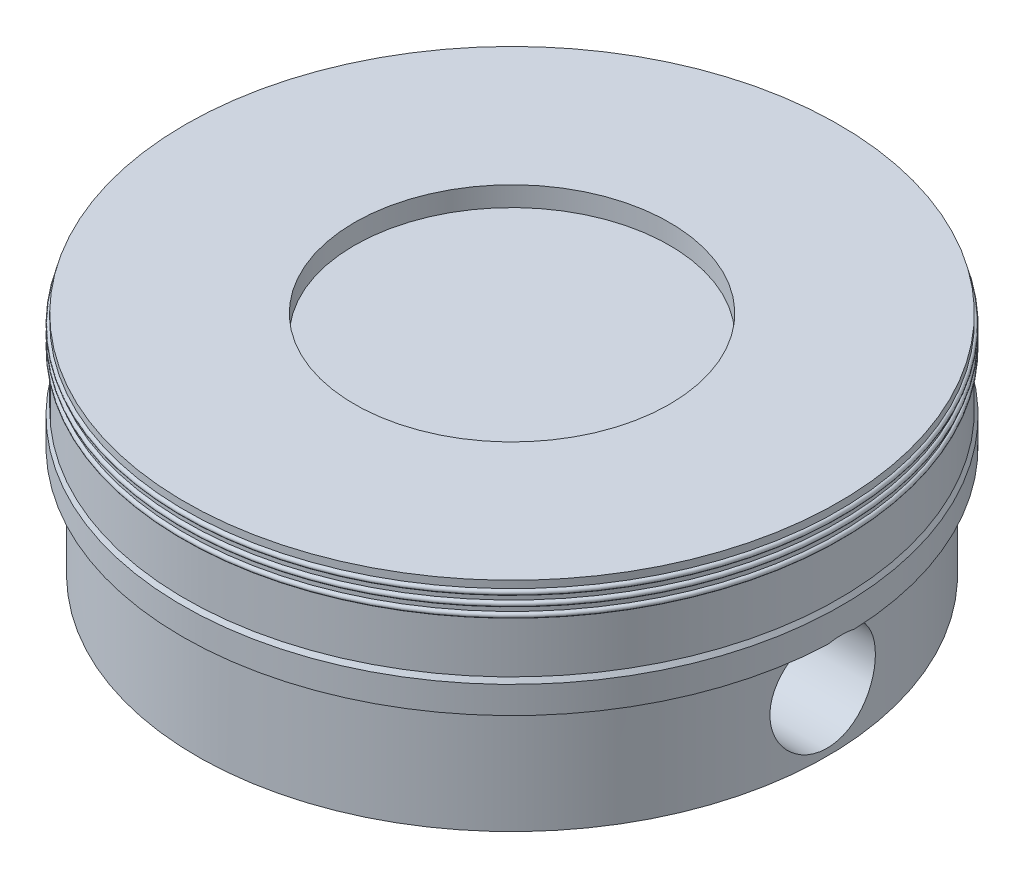
ISO-10303-21;
HEADER;
FILE_DESCRIPTION(('STEP AP214'),'2;1');
FILE_NAME('part.step','',(''),(''),'','','');
FILE_SCHEMA(('AUTOMOTIVE_DESIGN { 1 0 10303 214 1 1 1 1 }'));
ENDSEC;
DATA;
#1=APPLICATION_CONTEXT('core data for automotive mechanical design processes');
#2=APPLICATION_PROTOCOL_DEFINITION('international standard','automotive_design',2000,#1);
#3=PRODUCT_CONTEXT('',#1,'mechanical');
#4=PRODUCT('Part','Part','',(#3));
#5=PRODUCT_RELATED_PRODUCT_CATEGORY('part','',(#4));
#6=PRODUCT_DEFINITION_FORMATION('','',#4);
#7=PRODUCT_DEFINITION_CONTEXT('part definition',#1,'design');
#8=PRODUCT_DEFINITION('design','',#6,#7);
#9=PRODUCT_DEFINITION_SHAPE('','',#8);
#10=(LENGTH_UNIT() NAMED_UNIT(*) SI_UNIT(.MILLI.,.METRE.));
#11=(NAMED_UNIT(*) PLANE_ANGLE_UNIT() SI_UNIT($,.RADIAN.));
#12=(NAMED_UNIT(*) SI_UNIT($,.STERADIAN.) SOLID_ANGLE_UNIT());
#13=UNCERTAINTY_MEASURE_WITH_UNIT(LENGTH_MEASURE(1.E-05),#10,'distance_accuracy_value','');
#14=(GEOMETRIC_REPRESENTATION_CONTEXT(3) GLOBAL_UNCERTAINTY_ASSIGNED_CONTEXT((#13)) GLOBAL_UNIT_ASSIGNED_CONTEXT((#10,
#11,#12)) REPRESENTATION_CONTEXT('',''));
#15=CARTESIAN_POINT('',(0.,0.,0.));
#16=DIRECTION('',(0.,0.,1.));
#17=DIRECTION('',(1.,0.,0.));
#18=AXIS2_PLACEMENT_3D('',#15,#16,#17);
#19=CARTESIAN_POINT('',(0.,1.68000000000001,0.));
#20=DIRECTION('',(0.,-1.,0.));
#21=DIRECTION('',(1.,0.,0.));
#22=AXIS2_PLACEMENT_3D('',#19,#20,#21);
#23=PLANE('',#22);
#24=DIRECTION('',(1.,0.,0.));
#25=VECTOR('',#24,1.);
#26=CARTESIAN_POINT('',(-4.99999999999999,1.68000000000001,-0.204200269343562));
#27=LINE('',#26,#25);
#28=CARTESIAN_POINT('',(-4.99582848484613,1.68000000000001,-0.204200269343562));
#29=VERTEX_POINT('',#28);
#30=CARTESIAN_POINT('',(-4.77563631885846,1.68000000000001,-0.204200269343562));
#31=VERTEX_POINT('',#30);
#32=EDGE_CURVE('E233',#29,#31,#27,.T.);
#33=ORIENTED_EDGE('',*,*,#32,.F.);
#34=CARTESIAN_POINT('',(0.,1.68000000000001,0.));
#35=DIRECTION('',(0.,1.,0.));
#36=DIRECTION('',(-1.,0.,0.));
#37=AXIS2_PLACEMENT_3D('',#34,#35,#36);
#38=CIRCLE('',#37,5.);
#39=CARTESIAN_POINT('',(4.99582848484613,1.68000000000001,-0.204200269343562));
#40=VERTEX_POINT('',#39);
#41=EDGE_CURVE('E141',#40,#29,#38,.T.);
#42=ORIENTED_EDGE('',*,*,#41,.F.);
#43=CARTESIAN_POINT('',(4.77563631885846,1.68000000000001,-0.204200269343562));
#44=VERTEX_POINT('',#43);
#45=EDGE_CURVE('E122',#44,#40,#27,.T.);
#46=ORIENTED_EDGE('',*,*,#45,.F.);
#47=CARTESIAN_POINT('',(0.,1.68000000000001,0.));
#48=DIRECTION('',(0.,1.,0.));
#49=DIRECTION('',(-1.,0.,0.));
#50=AXIS2_PLACEMENT_3D('',#47,#48,#49);
#51=CIRCLE('',#50,4.78);
#52=EDGE_CURVE('E47',#44,#31,#51,.T.);
#53=ORIENTED_EDGE('',*,*,#52,.T.);
#54=EDGE_LOOP('',(#33,#42,#46,#53));
#55=FACE_BOUND('',#54,.T.);
#56=ADVANCED_FACE('F37',(#55),#23,.T.);
#57=CARTESIAN_POINT('',(0.,3.,0.));
#58=DIRECTION('',(0.,1.,0.));
#59=DIRECTION('',(-1.,0.,0.));
#60=AXIS2_PLACEMENT_3D('',#57,#58,#59);
#61=CYLINDRICAL_SURFACE('',#60,3.43);
#62=DIRECTION('',(0.,-1.,0.));
#63=VECTOR('',#62,1.);
#64=CARTESIAN_POINT('',(1.75,3.432,2.94998305079877));
#65=LINE('',#64,#63);
#66=CARTESIAN_POINT('',(1.75,1.93000000000001,2.94998305079877));
#67=VERTEX_POINT('',#66);
#68=CARTESIAN_POINT('',(1.75,0.,2.94998305079877));
#69=VERTEX_POINT('',#68);
#70=EDGE_CURVE('E215',#67,#69,#65,.T.);
#71=ORIENTED_EDGE('',*,*,#70,.T.);
#72=CARTESIAN_POINT('',(0.,0.,0.));
#73=DIRECTION('',(0.,1.,0.));
#74=DIRECTION('',(-1.,0.,0.));
#75=AXIS2_PLACEMENT_3D('',#72,#73,#74);
#76=CIRCLE('',#75,3.43);
#77=CARTESIAN_POINT('',(-1.75,0.,2.94998305079877));
#78=VERTEX_POINT('',#77);
#79=EDGE_CURVE('E188',#78,#69,#76,.T.);
#80=ORIENTED_EDGE('',*,*,#79,.F.);
#81=DIRECTION('',(0.,-1.,0.));
#82=VECTOR('',#81,1.);
#83=CARTESIAN_POINT('',(-1.75,3.43200000000001,2.94998305079877));
#84=LINE('',#83,#82);
#85=CARTESIAN_POINT('',(-1.75,1.93000000000001,2.94998305079877));
#86=VERTEX_POINT('',#85);
#87=EDGE_CURVE('E204',#86,#78,#84,.T.);
#88=ORIENTED_EDGE('',*,*,#87,.F.);
#89=CARTESIAN_POINT('',(0.,1.93,0.));
#90=DIRECTION('',(0.,1.,0.));
#91=DIRECTION('',(-1.,0.,0.));
#92=AXIS2_PLACEMENT_3D('',#89,#90,#91);
#93=CIRCLE('',#92,3.43);
#94=EDGE_CURVE('E184',#86,#67,#93,.T.);
#95=ORIENTED_EDGE('',*,*,#94,.T.);
#96=EDGE_LOOP('',(#71,#80,#88,#95));
#97=FACE_BOUND('',#96,.T.);
#98=ADVANCED_FACE('F293',(#97),#61,.F.);
#99=CARTESIAN_POINT('',(0.,2.33,0.));
#100=DIRECTION('',(0.,-1.,0.));
#101=DIRECTION('',(1.,0.,0.));
#102=AXIS2_PLACEMENT_3D('',#99,#100,#101);
#103=PLANE('',#102);
#104=DIRECTION('',(0.,0.,1.));
#105=VECTOR('',#104,1.);
#106=CARTESIAN_POINT('',(1.75,2.33,2.94998305079877));
#107=LINE('',#106,#105);
#108=CARTESIAN_POINT('',(1.75,2.33,-2.94998305079877));
#109=VERTEX_POINT('',#108);
#110=CARTESIAN_POINT('',(1.75,2.33,2.94998305079877));
#111=VERTEX_POINT('',#110);
#112=EDGE_CURVE('E220',#109,#111,#107,.T.);
#113=ORIENTED_EDGE('',*,*,#112,.T.);
#114=CARTESIAN_POINT('',(0.,2.33,0.));
#115=DIRECTION('',(0.,-1.,0.));
#116=DIRECTION('',(1.,0.,0.));
#117=AXIS2_PLACEMENT_3D('',#114,#115,#116);
#118=CIRCLE('',#117,3.43);
#119=EDGE_CURVE('E53',#111,#109,#118,.F.);
#120=ORIENTED_EDGE('',*,*,#119,.T.);
#121=EDGE_LOOP('',(#113,#120));
#122=FACE_BOUND('',#121,.T.);
#123=CARTESIAN_POINT('',(0.,2.33,0.));
#124=DIRECTION('',(0.,1.,0.));
#125=DIRECTION('',(-1.,0.,0.));
#126=AXIS2_PLACEMENT_3D('',#123,#124,#125);
#127=CIRCLE('',#126,4.2);
#128=CARTESIAN_POINT('',(-4.2,2.33000000000001,0.));
#129=VERTEX_POINT('',#128);
#130=EDGE_CURVE('E178',#129,#129,#127,.T.);
#131=ORIENTED_EDGE('',*,*,#130,.F.);
#132=EDGE_LOOP('',(#131));
#133=FACE_BOUND('',#132,.T.);
#134=CARTESIAN_POINT('',(0.,2.33,0.));
#135=DIRECTION('',(0.,-1.,0.));
#136=DIRECTION('',(1.,0.,0.));
#137=AXIS2_PLACEMENT_3D('',#134,#135,#136);
#138=CIRCLE('',#137,3.43);
#139=CARTESIAN_POINT('',(-1.75,2.33,-2.94998305079877));
#140=VERTEX_POINT('',#139);
#141=CARTESIAN_POINT('',(-1.75,2.33,2.94998305079877));
#142=VERTEX_POINT('',#141);
#143=EDGE_CURVE('E197',#140,#142,#138,.F.);
#144=ORIENTED_EDGE('',*,*,#143,.T.);
#145=DIRECTION('',(0.,0.,1.));
#146=VECTOR('',#145,1.);
#147=CARTESIAN_POINT('',(-1.75,2.33,2.94998305079877));
#148=LINE('',#147,#146);
#149=EDGE_CURVE('E199',#140,#142,#148,.T.);
#150=ORIENTED_EDGE('',*,*,#149,.F.);
#151=EDGE_LOOP('',(#144,#150));
#152=FACE_BOUND('',#151,.T.);
#153=ADVANCED_FACE('F297',(#122,#133,#152),#103,.T.);
#154=DIRECTION('',(0.,-1.,0.));
#155=VECTOR('',#154,1.);
#156=CARTESIAN_POINT('',(1.75,3.432,-2.94998305079877));
#157=LINE('',#156,#155);
#158=CARTESIAN_POINT('',(1.75,1.93000000000001,-2.94998305079877));
#159=VERTEX_POINT('',#158);
#160=CARTESIAN_POINT('',(1.75,0.,-2.94998305079877));
#161=VERTEX_POINT('',#160);
#162=EDGE_CURVE('E221',#159,#161,#157,.T.);
#163=ORIENTED_EDGE('',*,*,#162,.F.);
#164=CARTESIAN_POINT('',(-1.75,1.93000000000001,-2.94998305079877));
#165=VERTEX_POINT('',#164);
#166=EDGE_CURVE('E187',#159,#165,#93,.T.);
#167=ORIENTED_EDGE('',*,*,#166,.T.);
#168=DIRECTION('',(0.,-1.,0.));
#169=VECTOR('',#168,1.);
#170=CARTESIAN_POINT('',(-1.75,3.43200000000001,-2.94998305079877));
#171=LINE('',#170,#169);
#172=CARTESIAN_POINT('',(-1.75,0.,-2.94998305079877));
#173=VERTEX_POINT('',#172);
#174=EDGE_CURVE('E208',#165,#173,#171,.T.);
#175=ORIENTED_EDGE('',*,*,#174,.T.);
#176=EDGE_CURVE('E190',#161,#173,#76,.T.);
#177=ORIENTED_EDGE('',*,*,#176,.F.);
#178=EDGE_LOOP('',(#163,#167,#175,#177));
#179=FACE_BOUND('',#178,.T.);
#180=ADVANCED_FACE('F270',(#179),#61,.F.);
#181=CARTESIAN_POINT('',(0.,3.,0.));
#182=DIRECTION('',(0.,1.,0.));
#183=DIRECTION('',(-1.,0.,0.));
#184=AXIS2_PLACEMENT_3D('',#181,#182,#183);
#185=CYLINDRICAL_SURFACE('',#184,4.78);
#186=CARTESIAN_POINT('',(4.77563631885846,1.68000000000001,0.204200269343563));
#187=CARTESIAN_POINT('',(4.77379194888552,1.66854243257559,0.247744412269015));
#188=CARTESIAN_POINT('',(4.77136020460173,1.65335275457684,0.290255843607151));
#189=CARTESIAN_POINT('',(4.76566971325088,1.61612915775611,0.372058639634219));
#190=CARTESIAN_POINT('',(4.76241182877571,1.59410237237228,0.411353306755982));
#191=CARTESIAN_POINT('',(4.75541096790897,1.54379414653232,0.485669109751144));
#192=CARTESIAN_POINT('',(4.75166791325191,1.51551169641929,0.520689554352583));
#193=CARTESIAN_POINT('',(4.74411777301411,1.45349253539825,0.585499496455732));
#194=CARTESIAN_POINT('',(4.74031069015471,1.41975605577735,0.615289215663266));
#195=CARTESIAN_POINT('',(4.73303397938829,1.34752861720674,0.668977437623667));
#196=CARTESIAN_POINT('',(4.7295665140548,1.30901033693919,0.692839507782637));
#197=CARTESIAN_POINT('',(4.72339287495312,1.22844891630061,0.733750408895781));
#198=CARTESIAN_POINT('',(4.72068674764335,1.18640556102538,0.750798824093428));
#199=CARTESIAN_POINT('',(4.71636619316509,1.1002697554691,0.777478565646616));
#200=CARTESIAN_POINT('',(4.71474486267495,1.05619220830362,0.787156848877914));
#201=CARTESIAN_POINT('',(4.71275674229363,0.967013656316141,0.798974764384111));
#202=CARTESIAN_POINT('',(4.71238978474061,0.921912789084297,0.801115404155711));
#203=CARTESIAN_POINT('',(4.71294983990002,0.832543950301121,0.797813291403519));
#204=CARTESIAN_POINT('',(4.71386133355064,0.788272487173632,0.792461490734872));
#205=CARTESIAN_POINT('',(4.71684522740921,0.701267723805134,0.774501739495555));
#206=CARTESIAN_POINT('',(4.71891766125525,0.658534468171649,0.761893578672604));
#207=CARTESIAN_POINT('',(4.723990672899,0.575744688228214,0.729777359832191));
#208=CARTESIAN_POINT('',(4.72699241086157,0.535691586324209,0.710260672658403));
#209=CARTESIAN_POINT('',(4.7335870697406,0.45940615327789,0.664888734674967));
#210=CARTESIAN_POINT('',(4.73718003553206,0.423174112502092,0.63903300265019));
#211=CARTESIAN_POINT('',(4.74460835399527,0.355074083527181,0.581331292128938));
#212=CARTESIAN_POINT('',(4.74844618692049,0.323266716440073,0.549414060942297));
#213=CARTESIAN_POINT('',(4.75589481733856,0.265438415229639,0.480684029234261));
#214=CARTESIAN_POINT('',(4.7595056074008,0.23941767041891,0.44387106860927));
#215=CARTESIAN_POINT('',(4.7661128241381,0.193797371595719,0.366186649534644));
#216=CARTESIAN_POINT('',(4.76910646912815,0.174226662901805,0.325297996806077));
#217=CARTESIAN_POINT('',(4.77412075413143,0.142248751906531,0.240753384230177));
#218=CARTESIAN_POINT('',(4.7761414668929,0.129841014000476,0.197097631561227));
#219=CARTESIAN_POINT('',(4.77896522061505,0.112661038381097,0.108739604313532));
#220=CARTESIAN_POINT('',(4.77978064110033,0.107811145780094,0.0640528262830952));
#221=CARTESIAN_POINT('',(4.78014164687173,0.105653249103118,-0.0255061274608446));
#222=CARTESIAN_POINT('',(4.7796873062372,0.10834480505024,-0.0703782922061621));
#223=CARTESIAN_POINT('',(4.77756972345959,0.1211268716496,-0.158615600759223));
#224=CARTESIAN_POINT('',(4.77591727299164,0.131151340047628,-0.201990600670429));
#225=CARTESIAN_POINT('',(4.77159751597352,0.158221853564904,-0.286436829840919));
#226=CARTESIAN_POINT('',(4.76893016987214,0.175268172332863,-0.327507969245515));
#227=CARTESIAN_POINT('',(4.7628526422157,0.216013300231182,-0.406465125420017));
#228=CARTESIAN_POINT('',(4.75943800733318,0.239752248368456,-0.444330074182973));
#229=CARTESIAN_POINT('',(4.75224918030118,0.293172302894461,-0.515569319292148));
#230=CARTESIAN_POINT('',(4.74847495896289,0.322853891882563,-0.548943250556414));
#231=CARTESIAN_POINT('',(4.74093522146089,0.387737081541062,-0.610666430914049));
#232=CARTESIAN_POINT('',(4.73717034238094,0.42300011947298,-0.638951217824194));
#233=CARTESIAN_POINT('',(4.73012045867175,0.49781429996308,-0.689207240280667));
#234=CARTESIAN_POINT('',(4.72683545162856,0.537365420948878,-0.711178507586868));
#235=CARTESIAN_POINT('',(4.72112414577725,0.619631105385101,-0.748156766963213));
#236=CARTESIAN_POINT('',(4.71869732861466,0.662343740331963,-0.763167964689311));
#237=CARTESIAN_POINT('',(4.7149837872348,0.749733086105556,-0.785786717984045));
#238=CARTESIAN_POINT('',(4.71369696033767,0.794409619661763,-0.79339494035089));
#239=CARTESIAN_POINT('',(4.71242375066639,0.883861115660366,-0.800922574806883));
#240=CARTESIAN_POINT('',(4.71242133866149,0.928627891215224,-0.8009367589262));
#241=CARTESIAN_POINT('',(4.71367692374763,1.01752032814329,-0.793513476008901));
#242=CARTESIAN_POINT('',(4.71493489933994,1.06164600043891,-0.786076136074619));
#243=CARTESIAN_POINT('',(4.71855673227796,1.14779364109366,-0.764032135205504));
#244=CARTESIAN_POINT('',(4.72091530598264,1.18982460995633,-0.749459711374084));
#245=CARTESIAN_POINT('',(4.72646953445655,1.27084839334425,-0.713591784913751));
#246=CARTESIAN_POINT('',(4.72966517057882,1.30984127552285,-0.692296432047134));
#247=CARTESIAN_POINT('',(4.73657457074216,1.3841212791375,-0.643332702364344));
#248=CARTESIAN_POINT('',(4.7402932895619,1.41936652165984,-0.615601505488156));
#249=CARTESIAN_POINT('',(4.74781191338595,1.48475232853069,-0.554637638840525));
#250=CARTESIAN_POINT('',(4.7516118616088,1.5148900952521,-0.521401973568539));
#251=CARTESIAN_POINT('',(4.75890914569777,1.56949101750667,-0.449983791452613));
#252=CARTESIAN_POINT('',(4.76240297685973,1.59389278081819,-0.411754019783373));
#253=CARTESIAN_POINT('',(4.76864221547192,1.63587199615418,-0.331736125546197));
#254=CARTESIAN_POINT('',(4.7713892580788,1.65346439427324,-0.289956044521578));
#255=CARTESIAN_POINT('',(4.77434621611889,1.67200558892752,-0.232863171892931));
#256=CARTESIAN_POINT('',(4.77502245159576,1.67620590067566,-0.218582892491788));
#257=CARTESIAN_POINT('',(4.77563631885846,1.68000000000001,-0.204200269343565));
#258=B_SPLINE_CURVE_WITH_KNOTS('',3,(#186,#187,#188,#189,#190,#191,#192,#193,#194,#195,#196,
#197,#198,#199,#200,#201,#202,#203,#204,#205,#206,#207,#208,#209,#210,#211,#212,#213,#214,#215,
#216,#217,#218,#219,#220,#221,#222,#223,#224,#225,#226,#227,#228,#229,#230,#231,#232,#233,#234,
#235,#236,#237,#238,#239,#240,#241,#242,#243,#244,#245,#246,#247,#248,#249,#250,#251,#252,#253,
#254,#255,#256,#257),.UNSPECIFIED.,.F.,.F.,(4,2,2,2,2,2,2,2,2,2,2,2,2,2,2,2,2,2,2,2,2,2,2,2,2,2,
2,2,2,2,2,2,2,2,2,4),(0.,0.134994326225649,0.269848278013811,0.404724010973234,
0.539594025804637,0.675273538402804,0.810961328648469,0.945777214580323,1.08057508006346,
1.21375072872941,1.3469302363402,1.48027668341513,1.61363325633846,1.74866713589456,
1.88370543251019,2.01933969090956,2.15496380606526,2.28918500918092,2.42339838183809,
2.5564176455071,2.68944209356374,2.82328197712698,2.95713273418294,3.09257498984084,
3.22801656415072,3.36337619022746,3.49872362311039,3.63238190809012,3.76603791326899,
3.89905877507421,4.0320766738697,4.16645204477797,4.30090078374122,4.43672892789274,
4.57225722456913,4.61693329590095),.UNSPECIFIED.);
#259=CARTESIAN_POINT('',(4.77563631885846,1.68000000000001,0.204200269343562));
#260=VERTEX_POINT('',#259);
#261=EDGE_CURVE('E255',#260,#44,#258,.T.);
#262=ORIENTED_EDGE('',*,*,#261,.F.);
#263=CARTESIAN_POINT('',(-4.77563631885846,1.68000000000001,0.204200269343562));
#264=VERTEX_POINT('',#263);
#265=EDGE_CURVE('E11',#264,#260,#51,.T.);
#266=ORIENTED_EDGE('',*,*,#265,.F.);
#267=CARTESIAN_POINT('',(-4.77563631885846,1.68000000000001,-0.204200269343563));
#268=CARTESIAN_POINT('',(-4.77379194888552,1.66854243257559,-0.247744412269015));
#269=CARTESIAN_POINT('',(-4.77136020460172,1.65335275457684,-0.290255843607151));
#270=CARTESIAN_POINT('',(-4.76566971325088,1.61612915775611,-0.372058639634219));
#271=CARTESIAN_POINT('',(-4.76241182877571,1.59410237237228,-0.411353306755982));
#272=CARTESIAN_POINT('',(-4.75541096790896,1.54379414653232,-0.485669109751144));
#273=CARTESIAN_POINT('',(-4.75166791325191,1.51551169641929,-0.520689554352583));
#274=CARTESIAN_POINT('',(-4.7441177730141,1.45349253539825,-0.585499496455732));
#275=CARTESIAN_POINT('',(-4.74031069015471,1.41975605577735,-0.615289215663266));
#276=CARTESIAN_POINT('',(-4.73303397938829,1.34752861720674,-0.668977437623667));
#277=CARTESIAN_POINT('',(-4.7295665140548,1.30901033693919,-0.692839507782637));
#278=CARTESIAN_POINT('',(-4.72339287495312,1.22844891630061,-0.733750408895781));
#279=CARTESIAN_POINT('',(-4.72068674764335,1.18640556102538,-0.750798824093428));
#280=CARTESIAN_POINT('',(-4.71636619316509,1.1002697554691,-0.777478565646616));
#281=CARTESIAN_POINT('',(-4.71474486267495,1.05619220830362,-0.787156848877914));
#282=CARTESIAN_POINT('',(-4.71275674229363,0.967013656316141,-0.798974764384111));
#283=CARTESIAN_POINT('',(-4.7123897847406,0.921912789084297,-0.801115404155711));
#284=CARTESIAN_POINT('',(-4.71294983990002,0.832543950301121,-0.797813291403519));
#285=CARTESIAN_POINT('',(-4.71386133355064,0.788272487173632,-0.792461490734872));
#286=CARTESIAN_POINT('',(-4.71684522740921,0.701267723805134,-0.774501739495555));
#287=CARTESIAN_POINT('',(-4.71891766125524,0.65853446817165,-0.761893578672604));
#288=CARTESIAN_POINT('',(-4.723990672899,0.575744688228215,-0.729777359832191));
#289=CARTESIAN_POINT('',(-4.72699241086157,0.535691586324209,-0.710260672658404));
#290=CARTESIAN_POINT('',(-4.7335870697406,0.459406153277891,-0.664888734674968));
#291=CARTESIAN_POINT('',(-4.73718003553206,0.423174112502093,-0.639033002650191));
#292=CARTESIAN_POINT('',(-4.74460835399527,0.355074083527182,-0.581331292128938));
#293=CARTESIAN_POINT('',(-4.74844618692049,0.323266716440074,-0.549414060942297));
#294=CARTESIAN_POINT('',(-4.75589481733856,0.265438415229639,-0.480684029234261));
#295=CARTESIAN_POINT('',(-4.7595056074008,0.23941767041891,-0.443871068609271));
#296=CARTESIAN_POINT('',(-4.7661128241381,0.193797371595719,-0.366186649534645));
#297=CARTESIAN_POINT('',(-4.76910646912815,0.174226662901805,-0.325297996806078));
#298=CARTESIAN_POINT('',(-4.77412075413143,0.142248751906531,-0.240753384230177));
#299=CARTESIAN_POINT('',(-4.7761414668929,0.129841014000476,-0.197097631561228));
#300=CARTESIAN_POINT('',(-4.77896522061505,0.112661038381097,-0.108739604313533));
#301=CARTESIAN_POINT('',(-4.77978064110033,0.107811145780094,-0.0640528262830958));
#302=CARTESIAN_POINT('',(-4.78014164687173,0.105653249103118,0.0255061274608441));
#303=CARTESIAN_POINT('',(-4.7796873062372,0.10834480505024,0.0703782922061616));
#304=CARTESIAN_POINT('',(-4.77756972345959,0.1211268716496,0.158615600759222));
#305=CARTESIAN_POINT('',(-4.77591727299164,0.131151340047627,0.201990600670429));
#306=CARTESIAN_POINT('',(-4.77159751597352,0.158221853564904,0.286436829840918));
#307=CARTESIAN_POINT('',(-4.76893016987214,0.175268172332863,0.327507969245514));
#308=CARTESIAN_POINT('',(-4.7628526422157,0.216013300231181,0.406465125420017));
#309=CARTESIAN_POINT('',(-4.75943800733318,0.239752248368456,0.444330074182973));
#310=CARTESIAN_POINT('',(-4.75224918030118,0.293172302894461,0.515569319292147));
#311=CARTESIAN_POINT('',(-4.74847495896288,0.322853891882563,0.548943250556413));
#312=CARTESIAN_POINT('',(-4.74093522146089,0.387737081541062,0.610666430914048));
#313=CARTESIAN_POINT('',(-4.73717034238094,0.423000119472979,0.638951217824193));
#314=CARTESIAN_POINT('',(-4.73012045867174,0.49781429996308,0.689207240280666));
#315=CARTESIAN_POINT('',(-4.72683545162856,0.537365420948878,0.711178507586868));
#316=CARTESIAN_POINT('',(-4.72112414577725,0.6196311053851,0.748156766963213));
#317=CARTESIAN_POINT('',(-4.71869732861466,0.662343740331962,0.763167964689311));
#318=CARTESIAN_POINT('',(-4.7149837872348,0.749733086105556,0.785786717984045));
#319=CARTESIAN_POINT('',(-4.71369696033767,0.794409619661763,0.79339494035089));
#320=CARTESIAN_POINT('',(-4.71242375066639,0.883861115660365,0.800922574806883));
#321=CARTESIAN_POINT('',(-4.71242133866149,0.928627891215223,0.8009367589262));
#322=CARTESIAN_POINT('',(-4.71367692374763,1.01752032814329,0.793513476008901));
#323=CARTESIAN_POINT('',(-4.71493489933994,1.06164600043891,0.786076136074619));
#324=CARTESIAN_POINT('',(-4.71855673227795,1.14779364109366,0.764032135205505));
#325=CARTESIAN_POINT('',(-4.72091530598264,1.18982460995633,0.749459711374084));
#326=CARTESIAN_POINT('',(-4.72646953445655,1.27084839334425,0.713591784913751));
#327=CARTESIAN_POINT('',(-4.72966517057881,1.30984127552285,0.692296432047134));
#328=CARTESIAN_POINT('',(-4.73657457074216,1.3841212791375,0.643332702364345));
#329=CARTESIAN_POINT('',(-4.74029328956189,1.41936652165984,0.615601505488156));
#330=CARTESIAN_POINT('',(-4.74781191338595,1.48475232853069,0.554637638840526));
#331=CARTESIAN_POINT('',(-4.75161186160879,1.5148900952521,0.52140197356854));
#332=CARTESIAN_POINT('',(-4.75890914569777,1.56949101750667,0.449983791452614));
#333=CARTESIAN_POINT('',(-4.76240297685973,1.59389278081819,0.411754019783374));
#334=CARTESIAN_POINT('',(-4.76864221547191,1.63587199615418,0.331736125546199));
#335=CARTESIAN_POINT('',(-4.77138925807879,1.65346439427323,0.289956044521579));
#336=CARTESIAN_POINT('',(-4.77434621611889,1.67200558892752,0.232863171892932));
#337=CARTESIAN_POINT('',(-4.77502245159576,1.67620590067566,0.218582892491788));
#338=CARTESIAN_POINT('',(-4.77563631885846,1.68000000000001,0.204200269343565));
#339=B_SPLINE_CURVE_WITH_KNOTS('',3,(#267,#268,#269,#270,#271,#272,#273,#274,#275,#276,#277,
#278,#279,#280,#281,#282,#283,#284,#285,#286,#287,#288,#289,#290,#291,#292,#293,#294,#295,#296,
#297,#298,#299,#300,#301,#302,#303,#304,#305,#306,#307,#308,#309,#310,#311,#312,#313,#314,#315,
#316,#317,#318,#319,#320,#321,#322,#323,#324,#325,#326,#327,#328,#329,#330,#331,#332,#333,#334,
#335,#336,#337,#338),.UNSPECIFIED.,.F.,.F.,(4,2,2,2,2,2,2,2,2,2,2,2,2,2,2,2,2,2,2,2,2,2,2,2,2,2,
2,2,2,2,2,2,2,2,2,4),(0.,0.134994326225649,0.26984827801381,0.404724010973234,0.539594025804638,
0.675273538402805,0.810961328648468,0.945777214580322,1.08057508006346,1.21375072872941,
1.3469302363402,1.48027668341513,1.61363325633846,1.74866713589456,1.88370543251019,
2.01933969090956,2.15496380606526,2.28918500918092,2.42339838183809,2.5564176455071,
2.68944209356373,2.82328197712697,2.95713273418293,3.09257498984084,3.22801656415072,
3.36337619022746,3.49872362311039,3.63238190809012,3.76603791326899,3.89905877507421,
4.0320766738697,4.16645204477797,4.30090078374122,4.43672892789274,4.57225722456913,
4.61693329590095),.UNSPECIFIED.);
#340=EDGE_CURVE('E216',#31,#264,#339,.T.);
#341=ORIENTED_EDGE('',*,*,#340,.F.);
#342=ORIENTED_EDGE('',*,*,#52,.F.);
#343=EDGE_LOOP('',(#262,#266,#341,#342));
#344=FACE_BOUND('',#343,.T.);
#345=CARTESIAN_POINT('',(0.,0.,0.));
#346=DIRECTION('',(0.,1.,0.));
#347=DIRECTION('',(-1.,0.,0.));
#348=AXIS2_PLACEMENT_3D('',#345,#346,#347);
#349=CIRCLE('',#348,4.78);
#350=CARTESIAN_POINT('',(-4.78,0.,0.));
#351=VERTEX_POINT('',#350);
#352=EDGE_CURVE('E191',#351,#351,#349,.T.);
#353=ORIENTED_EDGE('',*,*,#352,.T.);
#354=EDGE_LOOP('',(#353));
#355=FACE_BOUND('',#354,.T.);
#356=ADVANCED_FACE('F39',(#344,#355),#185,.T.);
#357=DIRECTION('',(1.,0.,0.));
#358=VECTOR('',#357,1.);
#359=CARTESIAN_POINT('',(-4.99999999999999,1.68000000000001,0.204200269343562));
#360=LINE('',#359,#358);
#361=CARTESIAN_POINT('',(4.99582848484613,1.68000000000001,0.204200269343562));
#362=VERTEX_POINT('',#361);
#363=EDGE_CURVE('E119',#362,#260,#360,.F.);
#364=ORIENTED_EDGE('',*,*,#363,.F.);
#365=CARTESIAN_POINT('',(-4.99582848484613,1.68000000000001,0.204200269343562));
#366=VERTEX_POINT('',#365);
#367=EDGE_CURVE('E133',#366,#362,#38,.T.);
#368=ORIENTED_EDGE('',*,*,#367,.F.);
#369=EDGE_CURVE('E136',#264,#366,#360,.F.);
#370=ORIENTED_EDGE('',*,*,#369,.F.);
#371=ORIENTED_EDGE('',*,*,#265,.T.);
#372=EDGE_LOOP('',(#364,#368,#370,#371));
#373=FACE_BOUND('',#372,.T.);
#374=ADVANCED_FACE('F131',(#373),#23,.T.);
#375=CARTESIAN_POINT('',(0.,3.,0.));
#376=DIRECTION('',(0.,1.,0.));
#377=DIRECTION('',(-1.,0.,0.));
#378=AXIS2_PLACEMENT_3D('',#375,#376,#377);
#379=CYLINDRICAL_SURFACE('',#378,5.);
#380=CARTESIAN_POINT('',(-4.99582848484613,1.68000000000001,0.204200269343562));
#381=CARTESIAN_POINT('',(-4.99671726527621,1.68573567061047,0.182470448526971));
#382=CARTESIAN_POINT('',(-4.99747214482284,1.69055442079516,0.160507025821663));
#383=CARTESIAN_POINT('',(-4.99869771630284,1.69833005884354,0.116238538748016));
#384=CARTESIAN_POINT('',(-4.99916832286337,1.70128638739636,0.0939333738077878));
#385=CARTESIAN_POINT('',(-5.00011402038239,1.70722470830864,0.0277239484351757));
#386=CARTESIAN_POINT('',(-5.00016427223512,1.7075354872144,-0.0164665349355464));
#387=CARTESIAN_POINT('',(-4.9993452065729,1.70239780322359,-0.0844772002821119));
#388=CARTESIAN_POINT('',(-4.99887889019158,1.69947412393191,-0.108529380491508));
#389=CARTESIAN_POINT('',(-4.99760713721798,1.6914146067021,-0.156550261147504));
#390=CARTESIAN_POINT('',(-4.99679767293207,1.68625247795535,-0.180514444994141));
#391=CARTESIAN_POINT('',(-4.99582848484614,1.68000000000027,-0.204200269343582));
#392=B_SPLINE_CURVE_WITH_KNOTS('',3,(#380,#381,#382,#383,#384,#385,#386,#387,#388,#389,#390,
#391),.UNSPECIFIED.,.F.,.F.,(4,2,2,2,2,4),(0.,0.0674275414034378,0.134875322585593,
0.266729456884676,0.339344094680218,0.412835733322129),.UNSPECIFIED.);
#393=EDGE_CURVE('E140',#366,#29,#392,.T.);
#394=ORIENTED_EDGE('',*,*,#393,.F.);
#395=ORIENTED_EDGE('',*,*,#367,.T.);
#396=CARTESIAN_POINT('',(4.99582848484613,1.68000000000001,-0.204200269343562));
#397=CARTESIAN_POINT('',(4.99671726527622,1.68573567061047,-0.182470448526971));
#398=CARTESIAN_POINT('',(4.99747214482285,1.69055442079516,-0.160507025821663));
#399=CARTESIAN_POINT('',(4.99869771630284,1.69833005884354,-0.116238538748016));
#400=CARTESIAN_POINT('',(4.99916832286338,1.70128638739636,-0.0939333738077879));
#401=CARTESIAN_POINT('',(5.00011402038239,1.70722470830864,-0.0277239484351758));
#402=CARTESIAN_POINT('',(5.00016427223512,1.7075354872144,0.0164665349355463));
#403=CARTESIAN_POINT('',(4.9993452065729,1.70239780322359,0.0844772002821118));
#404=CARTESIAN_POINT('',(4.99887889019159,1.69947412393191,0.108529380491508));
#405=CARTESIAN_POINT('',(4.99760713721798,1.6914146067021,0.156550261147504));
#406=CARTESIAN_POINT('',(4.99679767293207,1.68625247795535,0.180514444994141));
#407=CARTESIAN_POINT('',(4.99582848484614,1.68000000000027,0.204200269343582));
#408=B_SPLINE_CURVE_WITH_KNOTS('',3,(#396,#397,#398,#399,#400,#401,#402,#403,#404,#405,#406,
#407),.UNSPECIFIED.,.F.,.F.,(4,2,2,2,2,4),(0.,0.0674275414034378,0.134875322585593,
0.266729456884676,0.339344094680218,0.412835733322129),.UNSPECIFIED.);
#409=EDGE_CURVE('E115',#40,#362,#408,.T.);
#410=ORIENTED_EDGE('',*,*,#409,.F.);
#411=ORIENTED_EDGE('',*,*,#41,.T.);
#412=EDGE_LOOP('',(#394,#395,#410,#411));
#413=FACE_BOUND('',#412,.T.);
#414=CARTESIAN_POINT('',(0.,2.09000000000001,0.));
#415=DIRECTION('',(0.,1.,0.));
#416=DIRECTION('',(-1.,0.,0.));
#417=AXIS2_PLACEMENT_3D('',#414,#415,#416);
#418=CIRCLE('',#417,5.);
#419=CARTESIAN_POINT('',(-4.99999999999999,2.09000000000001,0.));
#420=VERTEX_POINT('',#419);
#421=EDGE_CURVE('E144',#420,#420,#418,.T.);
#422=ORIENTED_EDGE('',*,*,#421,.F.);
#423=EDGE_LOOP('',(#422));
#424=FACE_BOUND('',#423,.T.);
#425=ADVANCED_FACE('F138',(#413,#424),#379,.T.);
#426=CARTESIAN_POINT('',(0.,2.16000000000001,0.));
#427=DIRECTION('',(0.,-1.,0.));
#428=DIRECTION('',(1.,0.,0.));
#429=AXIS2_PLACEMENT_3D('',#426,#427,#428);
#430=CONICAL_SURFACE('',#429,4.96,0.519146114246532);
#431=ORIENTED_EDGE('',*,*,#421,.T.);
#432=EDGE_LOOP('',(#431));
#433=FACE_BOUND('',#432,.T.);
#434=CARTESIAN_POINT('',(0.,2.16000000000001,0.));
#435=DIRECTION('',(0.,1.,0.));
#436=DIRECTION('',(-1.,0.,0.));
#437=AXIS2_PLACEMENT_3D('',#434,#435,#436);
#438=CIRCLE('',#437,4.96);
#439=CARTESIAN_POINT('',(-4.95999999999999,2.16000000000001,0.));
#440=VERTEX_POINT('',#439);
#441=EDGE_CURVE('E148',#440,#440,#438,.T.);
#442=ORIENTED_EDGE('',*,*,#441,.F.);
#443=EDGE_LOOP('',(#442));
#444=FACE_BOUND('',#443,.T.);
#445=ADVANCED_FACE('F303',(#433,#444),#430,.T.);
#446=CARTESIAN_POINT('',(0.,3.,0.));
#447=DIRECTION('',(0.,1.,0.));
#448=DIRECTION('',(-1.,0.,0.));
#449=AXIS2_PLACEMENT_3D('',#446,#447,#448);
#450=CYLINDRICAL_SURFACE('',#449,4.96);
#451=ORIENTED_EDGE('',*,*,#441,.T.);
#452=EDGE_LOOP('',(#451));
#453=FACE_BOUND('',#452,.T.);
#454=CARTESIAN_POINT('',(0.,2.94000000000001,0.));
#455=DIRECTION('',(0.,1.,0.));
#456=DIRECTION('',(-1.,0.,0.));
#457=AXIS2_PLACEMENT_3D('',#454,#455,#456);
#458=CIRCLE('',#457,4.96);
#459=CARTESIAN_POINT('',(-4.95999999999999,2.94000000000001,0.));
#460=VERTEX_POINT('',#459);
#461=EDGE_CURVE('E151',#460,#460,#458,.T.);
#462=ORIENTED_EDGE('',*,*,#461,.F.);
#463=EDGE_LOOP('',(#462));
#464=FACE_BOUND('',#463,.T.);
#465=ADVANCED_FACE('F307',(#453,#464),#450,.T.);
#466=CARTESIAN_POINT('',(0.,2.98000000000001,0.));
#467=DIRECTION('',(0.,1.,0.));
#468=DIRECTION('',(-1.,0.,0.));
#469=AXIS2_PLACEMENT_3D('',#466,#467,#468);
#470=TOROIDAL_SURFACE('',#469,4.96,0.0400000000000001);
#471=CARTESIAN_POINT('',(0.,3.02000000000001,0.));
#472=DIRECTION('',(0.,1.,0.));
#473=DIRECTION('',(-1.,0.,0.));
#474=AXIS2_PLACEMENT_3D('',#471,#472,#473);
#475=CIRCLE('',#474,4.96);
#476=CARTESIAN_POINT('',(-4.95999999999999,3.02000000000001,0.));
#477=VERTEX_POINT('',#476);
#478=EDGE_CURVE('E154',#477,#477,#475,.T.);
#479=ORIENTED_EDGE('',*,*,#478,.F.);
#480=EDGE_LOOP('',(#479));
#481=FACE_BOUND('',#480,.T.);
#482=ORIENTED_EDGE('',*,*,#461,.T.);
#483=EDGE_LOOP('',(#482));
#484=FACE_BOUND('',#483,.T.);
#485=ADVANCED_FACE('F313',(#481,#484),#470,.T.);
#486=ORIENTED_EDGE('',*,*,#478,.T.);
#487=EDGE_LOOP('',(#486));
#488=FACE_BOUND('',#487,.T.);
#489=CARTESIAN_POINT('',(0.,3.09000000000001,0.));
#490=DIRECTION('',(0.,1.,0.));
#491=DIRECTION('',(-1.,0.,0.));
#492=AXIS2_PLACEMENT_3D('',#489,#490,#491);
#493=CIRCLE('',#492,4.96);
#494=CARTESIAN_POINT('',(-4.95999999999999,3.09000000000001,0.));
#495=VERTEX_POINT('',#494);
#496=EDGE_CURVE('E157',#495,#495,#493,.T.);
#497=ORIENTED_EDGE('',*,*,#496,.F.);
#498=EDGE_LOOP('',(#497));
#499=FACE_BOUND('',#498,.T.);
#500=ADVANCED_FACE('F316',(#488,#499),#450,.T.);
#501=CARTESIAN_POINT('',(0.,3.13000000000001,0.));
#502=DIRECTION('',(0.,1.,0.));
#503=DIRECTION('',(-1.,0.,0.));
#504=AXIS2_PLACEMENT_3D('',#501,#502,#503);
#505=TOROIDAL_SURFACE('',#504,4.96,0.0400000000000001);
#506=CARTESIAN_POINT('',(0.,3.17000000000001,0.));
#507=DIRECTION('',(0.,1.,0.));
#508=DIRECTION('',(-1.,0.,0.));
#509=AXIS2_PLACEMENT_3D('',#506,#507,#508);
#510=CIRCLE('',#509,4.96);
#511=CARTESIAN_POINT('',(-4.95999999999999,3.17000000000001,0.));
#512=VERTEX_POINT('',#511);
#513=EDGE_CURVE('E160',#512,#512,#510,.T.);
#514=ORIENTED_EDGE('',*,*,#513,.F.);
#515=EDGE_LOOP('',(#514));
#516=FACE_BOUND('',#515,.T.);
#517=ORIENTED_EDGE('',*,*,#496,.T.);
#518=EDGE_LOOP('',(#517));
#519=FACE_BOUND('',#518,.T.);
#520=ADVANCED_FACE('F318',(#516,#519),#505,.T.);
#521=ORIENTED_EDGE('',*,*,#513,.T.);
#522=EDGE_LOOP('',(#521));
#523=FACE_BOUND('',#522,.T.);
#524=CARTESIAN_POINT('',(0.,3.24000000000001,0.));
#525=DIRECTION('',(0.,1.,0.));
#526=DIRECTION('',(-1.,0.,0.));
#527=AXIS2_PLACEMENT_3D('',#524,#525,#526);
#528=CIRCLE('',#527,4.96);
#529=CARTESIAN_POINT('',(-4.95999999999999,3.24000000000001,0.));
#530=VERTEX_POINT('',#529);
#531=EDGE_CURVE('E163',#530,#530,#528,.T.);
#532=ORIENTED_EDGE('',*,*,#531,.F.);
#533=EDGE_LOOP('',(#532));
#534=FACE_BOUND('',#533,.T.);
#535=ADVANCED_FACE('F321',(#523,#534),#450,.T.);
#536=CARTESIAN_POINT('',(0.,3.28000000000001,0.));
#537=DIRECTION('',(0.,1.,0.));
#538=DIRECTION('',(-1.,0.,0.));
#539=AXIS2_PLACEMENT_3D('',#536,#537,#538);
#540=TOROIDAL_SURFACE('',#539,4.96,0.0400000000000001);
#541=CARTESIAN_POINT('',(0.,3.32000000000001,0.));
#542=DIRECTION('',(0.,1.,0.));
#543=DIRECTION('',(-1.,0.,0.));
#544=AXIS2_PLACEMENT_3D('',#541,#542,#543);
#545=CIRCLE('',#544,4.96);
#546=CARTESIAN_POINT('',(-4.95999999999999,3.32000000000001,0.));
#547=VERTEX_POINT('',#546);
#548=EDGE_CURVE('E166',#547,#547,#545,.T.);
#549=ORIENTED_EDGE('',*,*,#548,.F.);
#550=EDGE_LOOP('',(#549));
#551=FACE_BOUND('',#550,.T.);
#552=ORIENTED_EDGE('',*,*,#531,.T.);
#553=EDGE_LOOP('',(#552));
#554=FACE_BOUND('',#553,.T.);
#555=ADVANCED_FACE('F323',(#551,#554),#540,.T.);
#556=ORIENTED_EDGE('',*,*,#548,.T.);
#557=EDGE_LOOP('',(#556));
#558=FACE_BOUND('',#557,.T.);
#559=CARTESIAN_POINT('',(0.,3.43000000000001,0.));
#560=DIRECTION('',(0.,1.,0.));
#561=DIRECTION('',(-1.,0.,0.));
#562=AXIS2_PLACEMENT_3D('',#559,#560,#561);
#563=CIRCLE('',#562,4.95999999999999);
#564=CARTESIAN_POINT('',(-4.95999999999999,3.43000000000001,0.));
#565=VERTEX_POINT('',#564);
#566=EDGE_CURVE('E169',#565,#565,#563,.T.);
#567=ORIENTED_EDGE('',*,*,#566,.F.);
#568=EDGE_LOOP('',(#567));
#569=FACE_BOUND('',#568,.T.);
#570=ADVANCED_FACE('F326',(#558,#569),#450,.T.);
#571=CARTESIAN_POINT('',(0.,3.43,0.));
#572=DIRECTION('',(0.,1.,0.));
#573=DIRECTION('',(-1.,0.,0.));
#574=AXIS2_PLACEMENT_3D('',#571,#572,#573);
#575=PLANE('',#574);
#576=ORIENTED_EDGE('',*,*,#566,.T.);
#577=EDGE_LOOP('',(#576));
#578=FACE_BOUND('',#577,.T.);
#579=CARTESIAN_POINT('',(0.,3.43,0.));
#580=DIRECTION('',(0.,1.,0.));
#581=DIRECTION('',(-1.,0.,0.));
#582=AXIS2_PLACEMENT_3D('',#579,#580,#581);
#583=CIRCLE('',#582,2.39);
#584=CARTESIAN_POINT('',(-2.38999999999999,3.43,0.));
#585=VERTEX_POINT('',#584);
#586=EDGE_CURVE('E172',#585,#585,#583,.T.);
#587=ORIENTED_EDGE('',*,*,#586,.F.);
#588=EDGE_LOOP('',(#587));
#589=FACE_BOUND('',#588,.T.);
#590=ADVANCED_FACE('F330',(#578,#589),#575,.T.);
#591=CARTESIAN_POINT('',(0.,3.,0.));
#592=DIRECTION('',(0.,1.,0.));
#593=DIRECTION('',(-1.,0.,0.));
#594=AXIS2_PLACEMENT_3D('',#591,#592,#593);
#595=CYLINDRICAL_SURFACE('',#594,2.39);
#596=ORIENTED_EDGE('',*,*,#586,.T.);
#597=EDGE_LOOP('',(#596));
#598=FACE_BOUND('',#597,.T.);
#599=CARTESIAN_POINT('',(0.,3.13,0.));
#600=DIRECTION('',(0.,1.,0.));
#601=DIRECTION('',(-1.,0.,0.));
#602=AXIS2_PLACEMENT_3D('',#599,#600,#601);
#603=CIRCLE('',#602,2.39);
#604=CARTESIAN_POINT('',(-2.38999999999999,3.13,0.));
#605=VERTEX_POINT('',#604);
#606=EDGE_CURVE('E175',#605,#605,#603,.T.);
#607=ORIENTED_EDGE('',*,*,#606,.F.);
#608=EDGE_LOOP('',(#607));
#609=FACE_BOUND('',#608,.T.);
#610=ADVANCED_FACE('F334',(#598,#609),#595,.F.);
#611=CARTESIAN_POINT('',(0.,3.13,0.));
#612=DIRECTION('',(0.,1.,0.));
#613=DIRECTION('',(-1.,0.,0.));
#614=AXIS2_PLACEMENT_3D('',#611,#612,#613);
#615=PLANE('',#614);
#616=ORIENTED_EDGE('',*,*,#606,.T.);
#617=EDGE_LOOP('',(#616));
#618=FACE_BOUND('',#617,.T.);
#619=ADVANCED_FACE('F338',(#618),#615,.T.);
#620=CARTESIAN_POINT('',(0.,3.,0.));
#621=DIRECTION('',(0.,1.,0.));
#622=DIRECTION('',(-1.,0.,0.));
#623=AXIS2_PLACEMENT_3D('',#620,#621,#622);
#624=CYLINDRICAL_SURFACE('',#623,4.2);
#625=ORIENTED_EDGE('',*,*,#130,.T.);
#626=EDGE_LOOP('',(#625));
#627=FACE_BOUND('',#626,.T.);
#628=CARTESIAN_POINT('',(0.,1.93,0.));
#629=DIRECTION('',(0.,1.,0.));
#630=DIRECTION('',(-1.,0.,0.));
#631=AXIS2_PLACEMENT_3D('',#628,#629,#630);
#632=CIRCLE('',#631,4.2);
#633=CARTESIAN_POINT('',(-4.2,1.93000000000001,0.));
#634=VERTEX_POINT('',#633);
#635=EDGE_CURVE('E181',#634,#634,#632,.T.);
#636=ORIENTED_EDGE('',*,*,#635,.F.);
#637=EDGE_LOOP('',(#636));
#638=FACE_BOUND('',#637,.T.);
#639=ADVANCED_FACE('F285',(#627,#638),#624,.F.);
#640=CARTESIAN_POINT('',(0.,1.93,0.));
#641=DIRECTION('',(0.,1.,0.));
#642=DIRECTION('',(-1.,0.,0.));
#643=AXIS2_PLACEMENT_3D('',#640,#641,#642);
#644=PLANE('',#643);
#645=ORIENTED_EDGE('',*,*,#635,.T.);
#646=EDGE_LOOP('',(#645));
#647=FACE_BOUND('',#646,.T.);
#648=ORIENTED_EDGE('',*,*,#94,.F.);
#649=CARTESIAN_POINT('',(0.,1.93,0.));
#650=DIRECTION('',(0.,1.,0.));
#651=DIRECTION('',(-1.,0.,0.));
#652=AXIS2_PLACEMENT_3D('',#649,#650,#651);
#653=CIRCLE('',#652,3.43);
#654=EDGE_CURVE('E194',#165,#86,#653,.T.);
#655=ORIENTED_EDGE('',*,*,#654,.F.);
#656=ORIENTED_EDGE('',*,*,#166,.F.);
#657=CARTESIAN_POINT('',(0.,1.93,0.));
#658=DIRECTION('',(0.,1.,0.));
#659=DIRECTION('',(-1.,0.,0.));
#660=AXIS2_PLACEMENT_3D('',#657,#658,#659);
#661=CIRCLE('',#660,3.43);
#662=EDGE_CURVE('E200',#67,#159,#661,.T.);
#663=ORIENTED_EDGE('',*,*,#662,.F.);
#664=EDGE_LOOP('',(#648,#655,#656,#663));
#665=FACE_BOUND('',#664,.T.);
#666=ADVANCED_FACE('F276',(#647,#665),#644,.T.);
#667=CARTESIAN_POINT('',(0.,0.,0.));
#668=DIRECTION('',(0.,-1.,0.));
#669=DIRECTION('',(1.,0.,0.));
#670=AXIS2_PLACEMENT_3D('',#667,#668,#669);
#671=PLANE('',#670);
#672=ORIENTED_EDGE('',*,*,#79,.T.);
#673=DIRECTION('',(0.,0.,-1.));
#674=VECTOR('',#673,1.);
#675=CARTESIAN_POINT('',(1.75,0.,2.94998305079877));
#676=LINE('',#675,#674);
#677=EDGE_CURVE('E61',#69,#161,#676,.T.);
#678=ORIENTED_EDGE('',*,*,#677,.T.);
#679=ORIENTED_EDGE('',*,*,#176,.T.);
#680=DIRECTION('',(0.,0.,-1.));
#681=VECTOR('',#680,1.);
#682=CARTESIAN_POINT('',(-1.75,0.,2.94998305079877));
#683=LINE('',#682,#681);
#684=EDGE_CURVE('E196',#78,#173,#683,.T.);
#685=ORIENTED_EDGE('',*,*,#684,.F.);
#686=EDGE_LOOP('',(#672,#678,#679,#685));
#687=FACE_BOUND('',#686,.T.);
#688=ORIENTED_EDGE('',*,*,#352,.F.);
#689=EDGE_LOOP('',(#688));
#690=FACE_BOUND('',#689,.T.);
#691=ADVANCED_FACE('F273',(#687,#690),#671,.T.);
#692=CARTESIAN_POINT('',(-1.75,3.43200000000001,2.94998305079877));
#693=DIRECTION('',(-1.,0.,0.));
#694=DIRECTION('',(0.,-1.,0.));
#695=AXIS2_PLACEMENT_3D('',#692,#693,#694);
#696=PLANE('',#695);
#697=CARTESIAN_POINT('',(-1.75,0.9065,0.));
#698=DIRECTION('',(-1.,0.,0.));
#699=DIRECTION('',(0.,-1.,0.));
#700=AXIS2_PLACEMENT_3D('',#697,#698,#699);
#701=CIRCLE('',#700,0.8);
#702=CARTESIAN_POINT('',(-1.75,0.1065,0.));
#703=VERTEX_POINT('',#702);
#704=EDGE_CURVE('E127',#703,#703,#701,.T.);
#705=ORIENTED_EDGE('',*,*,#704,.T.);
#706=EDGE_LOOP('',(#705));
#707=FACE_BOUND('',#706,.T.);
#708=EDGE_CURVE('E205',#140,#165,#171,.T.);
#709=ORIENTED_EDGE('',*,*,#708,.F.);
#710=ORIENTED_EDGE('',*,*,#149,.T.);
#711=EDGE_CURVE('E201',#142,#86,#84,.T.);
#712=ORIENTED_EDGE('',*,*,#711,.T.);
#713=ORIENTED_EDGE('',*,*,#87,.T.);
#714=ORIENTED_EDGE('',*,*,#684,.T.);
#715=ORIENTED_EDGE('',*,*,#174,.F.);
#716=EDGE_LOOP('',(#709,#710,#712,#713,#714,#715));
#717=FACE_BOUND('',#716,.T.);
#718=ADVANCED_FACE('F275',(#707,#717),#696,.F.);
#719=CARTESIAN_POINT('',(0.,3.43200000000001,0.));
#720=DIRECTION('',(0.,-1.,0.));
#721=DIRECTION('',(1.,0.,0.));
#722=AXIS2_PLACEMENT_3D('',#719,#720,#721);
#723=CYLINDRICAL_SURFACE('',#722,3.43);
#724=ORIENTED_EDGE('',*,*,#708,.T.);
#725=ORIENTED_EDGE('',*,*,#654,.T.);
#726=ORIENTED_EDGE('',*,*,#711,.F.);
#727=ORIENTED_EDGE('',*,*,#143,.F.);
#728=EDGE_LOOP('',(#724,#725,#726,#727));
#729=FACE_BOUND('',#728,.T.);
#730=ADVANCED_FACE('F278',(#729),#723,.T.);
#731=CARTESIAN_POINT('',(1.75,3.432,2.94998305079877));
#732=DIRECTION('',(-1.,0.,0.));
#733=DIRECTION('',(0.,-1.,0.));
#734=AXIS2_PLACEMENT_3D('',#731,#732,#733);
#735=PLANE('',#734);
#736=CARTESIAN_POINT('',(1.75,0.9065,0.));
#737=DIRECTION('',(-1.,0.,0.));
#738=DIRECTION('',(0.,-1.,0.));
#739=AXIS2_PLACEMENT_3D('',#736,#737,#738);
#740=CIRCLE('',#739,0.8);
#741=CARTESIAN_POINT('',(1.75,0.1065,0.));
#742=VERTEX_POINT('',#741);
#743=EDGE_CURVE('E42',#742,#742,#740,.T.);
#744=ORIENTED_EDGE('',*,*,#743,.F.);
#745=EDGE_LOOP('',(#744));
#746=FACE_BOUND('',#745,.T.);
#747=ORIENTED_EDGE('',*,*,#112,.F.);
#748=EDGE_CURVE('E217',#109,#159,#157,.T.);
#749=ORIENTED_EDGE('',*,*,#748,.T.);
#750=ORIENTED_EDGE('',*,*,#162,.T.);
#751=ORIENTED_EDGE('',*,*,#677,.F.);
#752=ORIENTED_EDGE('',*,*,#70,.F.);
#753=EDGE_CURVE('E222',#111,#67,#65,.T.);
#754=ORIENTED_EDGE('',*,*,#753,.F.);
#755=EDGE_LOOP('',(#747,#749,#750,#751,#752,#754));
#756=FACE_BOUND('',#755,.T.);
#757=ADVANCED_FACE('F245',(#746,#756),#735,.T.);
#758=CARTESIAN_POINT('',(0.,3.43200000000001,0.));
#759=DIRECTION('',(0.,-1.,0.));
#760=DIRECTION('',(1.,0.,0.));
#761=AXIS2_PLACEMENT_3D('',#758,#759,#760);
#762=CYLINDRICAL_SURFACE('',#761,3.43);
#763=ORIENTED_EDGE('',*,*,#753,.T.);
#764=ORIENTED_EDGE('',*,*,#662,.T.);
#765=ORIENTED_EDGE('',*,*,#748,.F.);
#766=ORIENTED_EDGE('',*,*,#119,.F.);
#767=EDGE_LOOP('',(#763,#764,#765,#766));
#768=FACE_BOUND('',#767,.T.);
#769=ADVANCED_FACE('F244',(#768),#762,.T.);
#770=CARTESIAN_POINT('',(-5.,0.9065,0.));
#771=DIRECTION('',(1.,0.,0.));
#772=DIRECTION('',(0.,0.,-1.));
#773=AXIS2_PLACEMENT_3D('',#770,#771,#772);
#774=CYLINDRICAL_SURFACE('',#773,0.8);
#775=ORIENTED_EDGE('',*,*,#261,.T.);
#776=ORIENTED_EDGE('',*,*,#45,.T.);
#777=ORIENTED_EDGE('',*,*,#409,.T.);
#778=ORIENTED_EDGE('',*,*,#363,.T.);
#779=EDGE_LOOP('',(#775,#776,#777,#778));
#780=FACE_BOUND('',#779,.T.);
#781=ORIENTED_EDGE('',*,*,#743,.T.);
#782=EDGE_LOOP('',(#781));
#783=FACE_BOUND('',#782,.T.);
#784=ADVANCED_FACE('F117',(#780,#783),#774,.F.);
#785=ORIENTED_EDGE('',*,*,#340,.T.);
#786=ORIENTED_EDGE('',*,*,#369,.T.);
#787=ORIENTED_EDGE('',*,*,#393,.T.);
#788=ORIENTED_EDGE('',*,*,#32,.T.);
#789=EDGE_LOOP('',(#785,#786,#787,#788));
#790=FACE_BOUND('',#789,.T.);
#791=ORIENTED_EDGE('',*,*,#704,.F.);
#792=EDGE_LOOP('',(#791));
#793=FACE_BOUND('',#792,.T.);
#794=ADVANCED_FACE('F243',(#790,#793),#774,.F.);
#795=CLOSED_SHELL('',(#56,#98,#153,#180,#356,#374,#425,#445,#465,#485,#500,#520,#535,#555,#570,
#590,#610,#619,#639,#666,#691,#718,#730,#757,#769,#784,#794));
#796=MANIFOLD_SOLID_BREP('B2',#795);
#797=ADVANCED_BREP_SHAPE_REPRESENTATION('',(#18,#796),#14);
#798=SHAPE_DEFINITION_REPRESENTATION(#9,#797);
ENDSEC;
END-ISO-10303-21;
